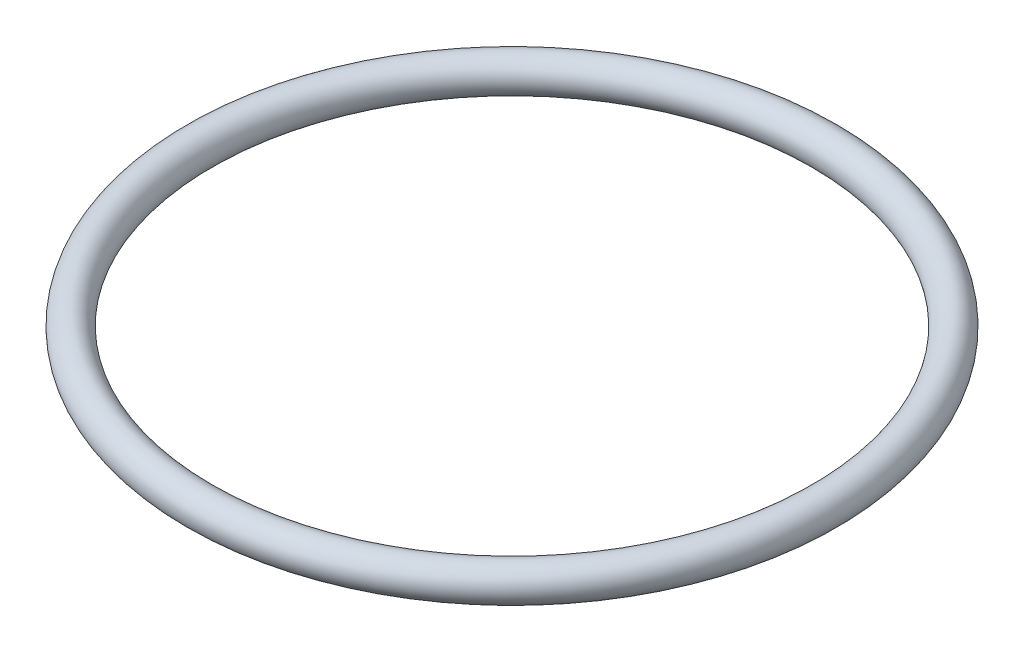
ISO-10303-21;
HEADER;
FILE_DESCRIPTION(('STEP AP214'),'2;1');
FILE_NAME('part.step','',(''),(''),'','','');
FILE_SCHEMA(('AUTOMOTIVE_DESIGN { 1 0 10303 214 1 1 1 1 }'));
ENDSEC;
DATA;
#1=APPLICATION_CONTEXT('core data for automotive mechanical design processes');
#2=APPLICATION_PROTOCOL_DEFINITION('international standard','automotive_design',2000,#1);
#3=PRODUCT_CONTEXT('',#1,'mechanical');
#4=PRODUCT('Part','Part','',(#3));
#5=PRODUCT_RELATED_PRODUCT_CATEGORY('part','',(#4));
#6=PRODUCT_DEFINITION_FORMATION('','',#4);
#7=PRODUCT_DEFINITION_CONTEXT('part definition',#1,'design');
#8=PRODUCT_DEFINITION('design','',#6,#7);
#9=PRODUCT_DEFINITION_SHAPE('','',#8);
#10=(LENGTH_UNIT() NAMED_UNIT(*) SI_UNIT(.MILLI.,.METRE.));
#11=(NAMED_UNIT(*) PLANE_ANGLE_UNIT() SI_UNIT($,.RADIAN.));
#12=(NAMED_UNIT(*) SI_UNIT($,.STERADIAN.) SOLID_ANGLE_UNIT());
#13=UNCERTAINTY_MEASURE_WITH_UNIT(LENGTH_MEASURE(1.E-05),#10,'distance_accuracy_value','');
#14=(GEOMETRIC_REPRESENTATION_CONTEXT(3) GLOBAL_UNCERTAINTY_ASSIGNED_CONTEXT((#13)) GLOBAL_UNIT_ASSIGNED_CONTEXT((#10,
#11,#12)) REPRESENTATION_CONTEXT('',''));
#15=CARTESIAN_POINT('',(0.,0.,0.));
#16=DIRECTION('',(0.,0.,1.));
#17=DIRECTION('',(1.,0.,0.));
#18=AXIS2_PLACEMENT_3D('',#15,#16,#17);
#19=CARTESIAN_POINT('',(0.,1.67869274654296,0.));
#20=DIRECTION('',(0.,1.,0.));
#21=DIRECTION('',(0.,0.,1.));
#22=AXIS2_PLACEMENT_3D('',#19,#20,#21);
#23=TOROIDAL_SURFACE('',#22,31.775,1.775);
#24=CARTESIAN_POINT('',(0.,1.67869274654296,33.55));
#25=VERTEX_POINT('',#24);
#26=VERTEX_LOOP('',#25);
#27=FACE_BOUND('',#26,.T.);
#28=ADVANCED_FACE('F29',(#27),#23,.T.);
#29=CLOSED_SHELL('',(#28));
#30=MANIFOLD_SOLID_BREP('B2',#29);
#31=ADVANCED_BREP_SHAPE_REPRESENTATION('',(#18,#30),#14);
#32=SHAPE_DEFINITION_REPRESENTATION(#9,#31);
ENDSEC;
END-ISO-10303-21;
